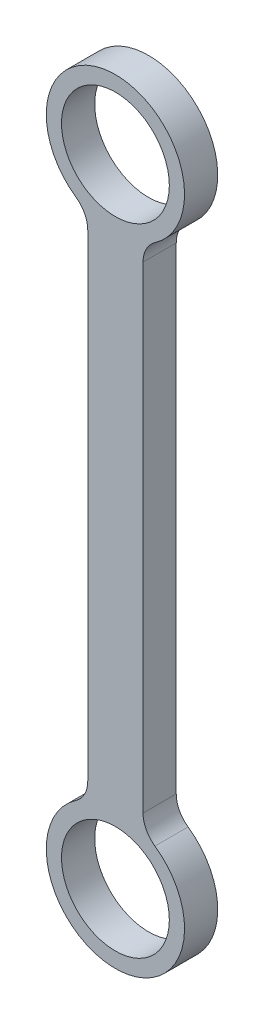
ISO-10303-21;
HEADER;
FILE_DESCRIPTION(('STEP AP214'),'2;1');
FILE_NAME('part.step','',(''),(''),'','','');
FILE_SCHEMA(('AUTOMOTIVE_DESIGN { 1 0 10303 214 1 1 1 1 }'));
ENDSEC;
DATA;
#1=APPLICATION_CONTEXT('core data for automotive mechanical design processes');
#2=APPLICATION_PROTOCOL_DEFINITION('international standard','automotive_design',2000,#1);
#3=PRODUCT_CONTEXT('',#1,'mechanical');
#4=PRODUCT('Part','Part','',(#3));
#5=PRODUCT_RELATED_PRODUCT_CATEGORY('part','',(#4));
#6=PRODUCT_DEFINITION_FORMATION('','',#4);
#7=PRODUCT_DEFINITION_CONTEXT('part definition',#1,'design');
#8=PRODUCT_DEFINITION('design','',#6,#7);
#9=PRODUCT_DEFINITION_SHAPE('','',#8);
#10=(LENGTH_UNIT() NAMED_UNIT(*) SI_UNIT(.MILLI.,.METRE.));
#11=(NAMED_UNIT(*) PLANE_ANGLE_UNIT() SI_UNIT($,.RADIAN.));
#12=(NAMED_UNIT(*) SI_UNIT($,.STERADIAN.) SOLID_ANGLE_UNIT());
#13=UNCERTAINTY_MEASURE_WITH_UNIT(LENGTH_MEASURE(1.E-05),#10,'distance_accuracy_value','');
#14=(GEOMETRIC_REPRESENTATION_CONTEXT(3) GLOBAL_UNCERTAINTY_ASSIGNED_CONTEXT((#13)) GLOBAL_UNIT_ASSIGNED_CONTEXT((#10,
#11,#12)) REPRESENTATION_CONTEXT('',''));
#15=CARTESIAN_POINT('',(0.,0.,0.));
#16=DIRECTION('',(0.,0.,1.));
#17=DIRECTION('',(1.,0.,0.));
#18=AXIS2_PLACEMENT_3D('',#15,#16,#17);
#19=CARTESIAN_POINT('',(0.,0.,6.));
#20=DIRECTION('',(0.,0.,-1.));
#21=DIRECTION('',(-1.,0.,0.));
#22=AXIS2_PLACEMENT_3D('',#19,#20,#21);
#23=CYLINDRICAL_SURFACE('',#22,12.5);
#24=CARTESIAN_POINT('',(0.,0.,0.));
#25=DIRECTION('',(0.,0.,1.));
#26=DIRECTION('',(1.,0.,0.));
#27=AXIS2_PLACEMENT_3D('',#24,#25,#26);
#28=CIRCLE('',#27,12.5);
#29=CARTESIAN_POINT('',(-7.14285714285714,10.2581475831036,0.));
#30=VERTEX_POINT('',#29);
#31=CARTESIAN_POINT('',(7.14285714285714,10.2581475831036,0.));
#32=VERTEX_POINT('',#31);
#33=EDGE_CURVE('E126',#30,#32,#28,.T.);
#34=ORIENTED_EDGE('',*,*,#33,.T.);
#35=DIRECTION('',(0.,0.,-1.));
#36=VECTOR('',#35,1.);
#37=CARTESIAN_POINT('',(7.14285714285714,10.2581475831036,6.));
#38=LINE('',#37,#36);
#39=CARTESIAN_POINT('',(7.14285714285714,10.2581475831036,6.));
#40=VERTEX_POINT('',#39);
#41=EDGE_CURVE('E105',#32,#40,#38,.F.);
#42=ORIENTED_EDGE('',*,*,#41,.T.);
#43=CARTESIAN_POINT('',(0.,0.,6.));
#44=DIRECTION('',(0.,0.,1.));
#45=DIRECTION('',(1.,0.,0.));
#46=AXIS2_PLACEMENT_3D('',#43,#44,#45);
#47=CIRCLE('',#46,12.5);
#48=CARTESIAN_POINT('',(-7.14285714285714,10.2581475831036,6.));
#49=VERTEX_POINT('',#48);
#50=EDGE_CURVE('E141',#49,#40,#47,.T.);
#51=ORIENTED_EDGE('',*,*,#50,.F.);
#52=DIRECTION('',(0.,0.,-1.));
#53=VECTOR('',#52,1.);
#54=CARTESIAN_POINT('',(-7.14285714285714,10.2581475831036,6.));
#55=LINE('',#54,#53);
#56=EDGE_CURVE('E119',#49,#30,#55,.T.);
#57=ORIENTED_EDGE('',*,*,#56,.T.);
#58=EDGE_LOOP('',(#34,#42,#51,#57));
#59=FACE_BOUND('',#58,.T.);
#60=ADVANCED_FACE('F35',(#59),#23,.T.);
#61=CARTESIAN_POINT('',(5.,0.,6.));
#62=DIRECTION('',(-1.,0.,0.));
#63=DIRECTION('',(0.,0.,1.));
#64=AXIS2_PLACEMENT_3D('',#61,#62,#63);
#65=PLANE('',#64);
#66=DIRECTION('',(0.,1.,0.));
#67=VECTOR('',#66,1.);
#68=CARTESIAN_POINT('',(5.,0.,6.));
#69=LINE('',#68,#67);
#70=CARTESIAN_POINT('',(5.,14.3614066163451,6.));
#71=VERTEX_POINT('',#70);
#72=CARTESIAN_POINT('',(5.,100.638593383655,6.));
#73=VERTEX_POINT('',#72);
#74=EDGE_CURVE('E118',#71,#73,#69,.T.);
#75=ORIENTED_EDGE('',*,*,#74,.F.);
#76=DIRECTION('',(0.,0.,1.));
#77=VECTOR('',#76,1.);
#78=CARTESIAN_POINT('',(5.,14.3614066163451,0.));
#79=LINE('',#78,#77);
#80=CARTESIAN_POINT('',(5.,14.3614066163451,0.));
#81=VERTEX_POINT('',#80);
#82=EDGE_CURVE('E104',#71,#81,#79,.F.);
#83=ORIENTED_EDGE('',*,*,#82,.T.);
#84=DIRECTION('',(0.,1.,0.));
#85=VECTOR('',#84,1.);
#86=CARTESIAN_POINT('',(5.,0.,0.));
#87=LINE('',#86,#85);
#88=CARTESIAN_POINT('',(5.,100.638593383655,0.));
#89=VERTEX_POINT('',#88);
#90=EDGE_CURVE('E116',#81,#89,#87,.T.);
#91=ORIENTED_EDGE('',*,*,#90,.T.);
#92=DIRECTION('',(0.,0.,1.));
#93=VECTOR('',#92,1.);
#94=CARTESIAN_POINT('',(5.,100.638593383655,6.));
#95=LINE('',#94,#93);
#96=EDGE_CURVE('E120',#89,#73,#95,.T.);
#97=ORIENTED_EDGE('',*,*,#96,.T.);
#98=EDGE_LOOP('',(#75,#83,#91,#97));
#99=FACE_BOUND('',#98,.T.);
#100=ADVANCED_FACE('F115',(#99),#65,.F.);
#101=CARTESIAN_POINT('',(0.,115.,6.));
#102=DIRECTION('',(0.,0.,-1.));
#103=DIRECTION('',(-1.,0.,0.));
#104=AXIS2_PLACEMENT_3D('',#101,#102,#103);
#105=CYLINDRICAL_SURFACE('',#104,12.5);
#106=CARTESIAN_POINT('',(0.,115.,0.));
#107=DIRECTION('',(0.,0.,1.));
#108=DIRECTION('',(1.,0.,0.));
#109=AXIS2_PLACEMENT_3D('',#106,#107,#108);
#110=CIRCLE('',#109,12.5);
#111=CARTESIAN_POINT('',(7.14285714285715,104.741852416896,0.));
#112=VERTEX_POINT('',#111);
#113=CARTESIAN_POINT('',(-7.14285714285715,104.741852416896,0.));
#114=VERTEX_POINT('',#113);
#115=EDGE_CURVE('E125',#112,#114,#110,.T.);
#116=ORIENTED_EDGE('',*,*,#115,.T.);
#117=DIRECTION('',(0.,0.,-1.));
#118=VECTOR('',#117,1.);
#119=CARTESIAN_POINT('',(-7.14285714285714,104.741852416896,6.));
#120=LINE('',#119,#118);
#121=CARTESIAN_POINT('',(-7.14285714285715,104.741852416896,6.));
#122=VERTEX_POINT('',#121);
#123=EDGE_CURVE('E50',#114,#122,#120,.F.);
#124=ORIENTED_EDGE('',*,*,#123,.T.);
#125=CARTESIAN_POINT('',(0.,115.,6.));
#126=DIRECTION('',(0.,0.,1.));
#127=DIRECTION('',(1.,0.,0.));
#128=AXIS2_PLACEMENT_3D('',#125,#126,#127);
#129=CIRCLE('',#128,12.5);
#130=CARTESIAN_POINT('',(7.14285714285715,104.741852416896,6.));
#131=VERTEX_POINT('',#130);
#132=EDGE_CURVE('E171',#131,#122,#129,.T.);
#133=ORIENTED_EDGE('',*,*,#132,.F.);
#134=DIRECTION('',(0.,0.,-1.));
#135=VECTOR('',#134,1.);
#136=CARTESIAN_POINT('',(7.14285714285715,104.741852416896,6.));
#137=LINE('',#136,#135);
#138=EDGE_CURVE('E152',#131,#112,#137,.T.);
#139=ORIENTED_EDGE('',*,*,#138,.T.);
#140=EDGE_LOOP('',(#116,#124,#133,#139));
#141=FACE_BOUND('',#140,.T.);
#142=ADVANCED_FACE('F181',(#141),#105,.T.);
#143=CARTESIAN_POINT('',(0.,115.,6.));
#144=DIRECTION('',(0.,0.,-1.));
#145=DIRECTION('',(-1.,0.,0.));
#146=AXIS2_PLACEMENT_3D('',#143,#144,#145);
#147=CYLINDRICAL_SURFACE('',#146,9.75);
#148=CARTESIAN_POINT('',(0.,115.,6.));
#149=DIRECTION('',(0.,0.,1.));
#150=DIRECTION('',(1.,0.,0.));
#151=AXIS2_PLACEMENT_3D('',#148,#149,#150);
#152=CIRCLE('',#151,9.75);
#153=CARTESIAN_POINT('',(9.75,115.,6.));
#154=VERTEX_POINT('',#153);
#155=EDGE_CURVE('E178',#154,#154,#152,.T.);
#156=ORIENTED_EDGE('',*,*,#155,.T.);
#157=EDGE_LOOP('',(#156));
#158=FACE_BOUND('',#157,.T.);
#159=CARTESIAN_POINT('',(0.,115.,0.));
#160=DIRECTION('',(0.,0.,1.));
#161=DIRECTION('',(1.,0.,0.));
#162=AXIS2_PLACEMENT_3D('',#159,#160,#161);
#163=CIRCLE('',#162,9.75);
#164=CARTESIAN_POINT('',(9.75,115.,0.));
#165=VERTEX_POINT('',#164);
#166=EDGE_CURVE('E135',#165,#165,#163,.T.);
#167=ORIENTED_EDGE('',*,*,#166,.F.);
#168=EDGE_LOOP('',(#167));
#169=FACE_BOUND('',#168,.T.);
#170=ADVANCED_FACE('F262',(#158,#169),#147,.F.);
#171=CARTESIAN_POINT('',(-5.,0.,6.));
#172=DIRECTION('',(-1.,0.,0.));
#173=DIRECTION('',(0.,0.,1.));
#174=AXIS2_PLACEMENT_3D('',#171,#172,#173);
#175=PLANE('',#174);
#176=DIRECTION('',(0.,1.,0.));
#177=VECTOR('',#176,1.);
#178=CARTESIAN_POINT('',(-5.,0.,0.));
#179=LINE('',#178,#177);
#180=CARTESIAN_POINT('',(-5.,14.3614066163451,0.));
#181=VERTEX_POINT('',#180);
#182=CARTESIAN_POINT('',(-5.,100.638593383655,0.));
#183=VERTEX_POINT('',#182);
#184=EDGE_CURVE('E128',#181,#183,#179,.T.);
#185=ORIENTED_EDGE('',*,*,#184,.F.);
#186=DIRECTION('',(0.,0.,-1.));
#187=VECTOR('',#186,1.);
#188=CARTESIAN_POINT('',(-5.,14.3614066163451,6.));
#189=LINE('',#188,#187);
#190=CARTESIAN_POINT('',(-5.,14.3614066163451,6.));
#191=VERTEX_POINT('',#190);
#192=EDGE_CURVE('E150',#181,#191,#189,.F.);
#193=ORIENTED_EDGE('',*,*,#192,.T.);
#194=DIRECTION('',(0.,1.,0.));
#195=VECTOR('',#194,1.);
#196=CARTESIAN_POINT('',(-5.,0.,6.));
#197=LINE('',#196,#195);
#198=CARTESIAN_POINT('',(-5.,100.638593383655,6.));
#199=VERTEX_POINT('',#198);
#200=EDGE_CURVE('E169',#191,#199,#197,.T.);
#201=ORIENTED_EDGE('',*,*,#200,.T.);
#202=DIRECTION('',(0.,0.,-1.));
#203=VECTOR('',#202,1.);
#204=CARTESIAN_POINT('',(-5.,100.638593383655,6.));
#205=LINE('',#204,#203);
#206=EDGE_CURVE('E147',#199,#183,#205,.T.);
#207=ORIENTED_EDGE('',*,*,#206,.T.);
#208=EDGE_LOOP('',(#185,#193,#201,#207));
#209=FACE_BOUND('',#208,.T.);
#210=ADVANCED_FACE('F176',(#209),#175,.T.);
#211=CARTESIAN_POINT('',(0.,0.,6.));
#212=DIRECTION('',(0.,0.,-1.));
#213=DIRECTION('',(-1.,0.,0.));
#214=AXIS2_PLACEMENT_3D('',#211,#212,#213);
#215=CYLINDRICAL_SURFACE('',#214,9.75);
#216=CARTESIAN_POINT('',(0.,0.,6.));
#217=DIRECTION('',(0.,0.,1.));
#218=DIRECTION('',(1.,0.,0.));
#219=AXIS2_PLACEMENT_3D('',#216,#217,#218);
#220=CIRCLE('',#219,9.75);
#221=CARTESIAN_POINT('',(9.75,0.,6.));
#222=VERTEX_POINT('',#221);
#223=EDGE_CURVE('E142',#222,#222,#220,.T.);
#224=ORIENTED_EDGE('',*,*,#223,.T.);
#225=EDGE_LOOP('',(#224));
#226=FACE_BOUND('',#225,.T.);
#227=CARTESIAN_POINT('',(0.,0.,0.));
#228=DIRECTION('',(0.,0.,1.));
#229=DIRECTION('',(1.,0.,0.));
#230=AXIS2_PLACEMENT_3D('',#227,#228,#229);
#231=CIRCLE('',#230,9.75);
#232=CARTESIAN_POINT('',(9.75,0.,0.));
#233=VERTEX_POINT('',#232);
#234=EDGE_CURVE('E138',#233,#233,#231,.T.);
#235=ORIENTED_EDGE('',*,*,#234,.F.);
#236=EDGE_LOOP('',(#235));
#237=FACE_BOUND('',#236,.T.);
#238=ADVANCED_FACE('F193',(#226,#237),#215,.F.);
#239=CARTESIAN_POINT('',(0.,0.,6.));
#240=DIRECTION('',(0.,0.,1.));
#241=DIRECTION('',(1.,0.,0.));
#242=AXIS2_PLACEMENT_3D('',#239,#240,#241);
#243=PLANE('',#242);
#244=ORIENTED_EDGE('',*,*,#200,.F.);
#245=CARTESIAN_POINT('',(-10.,14.3614066163451,6.));
#246=DIRECTION('',(0.,0.,1.));
#247=DIRECTION('',(1.,0.,0.));
#248=AXIS2_PLACEMENT_3D('',#245,#246,#247);
#249=CIRCLE('',#248,5.);
#250=EDGE_CURVE('E159',#191,#49,#249,.F.);
#251=ORIENTED_EDGE('',*,*,#250,.T.);
#252=ORIENTED_EDGE('',*,*,#50,.T.);
#253=CARTESIAN_POINT('',(10.,14.3614066163451,6.));
#254=DIRECTION('',(0.,0.,1.));
#255=DIRECTION('',(1.,0.,0.));
#256=AXIS2_PLACEMENT_3D('',#253,#254,#255);
#257=CIRCLE('',#256,5.);
#258=EDGE_CURVE('E110',#40,#71,#257,.F.);
#259=ORIENTED_EDGE('',*,*,#258,.T.);
#260=ORIENTED_EDGE('',*,*,#74,.T.);
#261=CARTESIAN_POINT('',(10.,100.638593383655,6.));
#262=DIRECTION('',(0.,0.,1.));
#263=DIRECTION('',(1.,0.,0.));
#264=AXIS2_PLACEMENT_3D('',#261,#262,#263);
#265=CIRCLE('',#264,5.);
#266=EDGE_CURVE('E11',#73,#131,#265,.F.);
#267=ORIENTED_EDGE('',*,*,#266,.T.);
#268=ORIENTED_EDGE('',*,*,#132,.T.);
#269=CARTESIAN_POINT('',(-10.,100.638593383655,6.));
#270=DIRECTION('',(0.,0.,1.));
#271=DIRECTION('',(1.,0.,0.));
#272=AXIS2_PLACEMENT_3D('',#269,#270,#271);
#273=CIRCLE('',#272,5.);
#274=EDGE_CURVE('E163',#122,#199,#273,.F.);
#275=ORIENTED_EDGE('',*,*,#274,.T.);
#276=EDGE_LOOP('',(#244,#251,#252,#259,#260,#267,#268,#275));
#277=FACE_BOUND('',#276,.T.);
#278=ORIENTED_EDGE('',*,*,#155,.F.);
#279=EDGE_LOOP('',(#278));
#280=FACE_BOUND('',#279,.T.);
#281=ORIENTED_EDGE('',*,*,#223,.F.);
#282=EDGE_LOOP('',(#281));
#283=FACE_BOUND('',#282,.T.);
#284=ADVANCED_FACE('F167',(#277,#280,#283),#243,.T.);
#285=CARTESIAN_POINT('',(0.,0.,0.));
#286=DIRECTION('',(0.,0.,1.));
#287=DIRECTION('',(1.,0.,0.));
#288=AXIS2_PLACEMENT_3D('',#285,#286,#287);
#289=PLANE('',#288);
#290=ORIENTED_EDGE('',*,*,#33,.F.);
#291=CARTESIAN_POINT('',(-10.,14.3614066163451,0.));
#292=DIRECTION('',(0.,0.,1.));
#293=DIRECTION('',(1.,0.,0.));
#294=AXIS2_PLACEMENT_3D('',#291,#292,#293);
#295=CIRCLE('',#294,5.);
#296=EDGE_CURVE('E157',#30,#181,#295,.T.);
#297=ORIENTED_EDGE('',*,*,#296,.T.);
#298=ORIENTED_EDGE('',*,*,#184,.T.);
#299=CARTESIAN_POINT('',(-10.,100.638593383655,0.));
#300=DIRECTION('',(0.,0.,1.));
#301=DIRECTION('',(1.,0.,0.));
#302=AXIS2_PLACEMENT_3D('',#299,#300,#301);
#303=CIRCLE('',#302,5.);
#304=EDGE_CURVE('E161',#183,#114,#303,.T.);
#305=ORIENTED_EDGE('',*,*,#304,.T.);
#306=ORIENTED_EDGE('',*,*,#115,.F.);
#307=CARTESIAN_POINT('',(10.,100.638593383655,0.));
#308=DIRECTION('',(0.,0.,1.));
#309=DIRECTION('',(1.,0.,0.));
#310=AXIS2_PLACEMENT_3D('',#307,#308,#309);
#311=CIRCLE('',#310,5.);
#312=EDGE_CURVE('E43',#112,#89,#311,.T.);
#313=ORIENTED_EDGE('',*,*,#312,.T.);
#314=ORIENTED_EDGE('',*,*,#90,.F.);
#315=CARTESIAN_POINT('',(10.,14.3614066163451,0.));
#316=DIRECTION('',(0.,0.,1.));
#317=DIRECTION('',(1.,0.,0.));
#318=AXIS2_PLACEMENT_3D('',#315,#316,#317);
#319=CIRCLE('',#318,5.);
#320=EDGE_CURVE('E100',#81,#32,#319,.T.);
#321=ORIENTED_EDGE('',*,*,#320,.T.);
#322=EDGE_LOOP('',(#290,#297,#298,#305,#306,#313,#314,#321));
#323=FACE_BOUND('',#322,.T.);
#324=ORIENTED_EDGE('',*,*,#166,.T.);
#325=EDGE_LOOP('',(#324));
#326=FACE_BOUND('',#325,.T.);
#327=ORIENTED_EDGE('',*,*,#234,.T.);
#328=EDGE_LOOP('',(#327));
#329=FACE_BOUND('',#328,.T.);
#330=ADVANCED_FACE('F122',(#323,#326,#329),#289,.F.);
#331=CARTESIAN_POINT('',(10.,14.3614066163451,6.));
#332=DIRECTION('',(0.,0.,-1.));
#333=DIRECTION('',(-1.,0.,0.));
#334=AXIS2_PLACEMENT_3D('',#331,#332,#333);
#335=CYLINDRICAL_SURFACE('',#334,5.);
#336=ORIENTED_EDGE('',*,*,#258,.F.);
#337=ORIENTED_EDGE('',*,*,#41,.F.);
#338=ORIENTED_EDGE('',*,*,#320,.F.);
#339=ORIENTED_EDGE('',*,*,#82,.F.);
#340=EDGE_LOOP('',(#336,#337,#338,#339));
#341=FACE_BOUND('',#340,.T.);
#342=ADVANCED_FACE('F103',(#341),#335,.F.);
#343=CARTESIAN_POINT('',(-10.,14.3614066163451,6.));
#344=DIRECTION('',(0.,0.,-1.));
#345=DIRECTION('',(-1.,0.,0.));
#346=AXIS2_PLACEMENT_3D('',#343,#344,#345);
#347=CYLINDRICAL_SURFACE('',#346,5.);
#348=ORIENTED_EDGE('',*,*,#250,.F.);
#349=ORIENTED_EDGE('',*,*,#192,.F.);
#350=ORIENTED_EDGE('',*,*,#296,.F.);
#351=ORIENTED_EDGE('',*,*,#56,.F.);
#352=EDGE_LOOP('',(#348,#349,#350,#351));
#353=FACE_BOUND('',#352,.T.);
#354=ADVANCED_FACE('F215',(#353),#347,.F.);
#355=CARTESIAN_POINT('',(-10.,100.638593383655,6.));
#356=DIRECTION('',(0.,0.,-1.));
#357=DIRECTION('',(-1.,0.,0.));
#358=AXIS2_PLACEMENT_3D('',#355,#356,#357);
#359=CYLINDRICAL_SURFACE('',#358,5.);
#360=ORIENTED_EDGE('',*,*,#274,.F.);
#361=ORIENTED_EDGE('',*,*,#123,.F.);
#362=ORIENTED_EDGE('',*,*,#304,.F.);
#363=ORIENTED_EDGE('',*,*,#206,.F.);
#364=EDGE_LOOP('',(#360,#361,#362,#363));
#365=FACE_BOUND('',#364,.T.);
#366=ADVANCED_FACE('F180',(#365),#359,.F.);
#367=CARTESIAN_POINT('',(10.,100.638593383655,6.));
#368=DIRECTION('',(0.,0.,-1.));
#369=DIRECTION('',(-1.,0.,0.));
#370=AXIS2_PLACEMENT_3D('',#367,#368,#369);
#371=CYLINDRICAL_SURFACE('',#370,5.);
#372=ORIENTED_EDGE('',*,*,#266,.F.);
#373=ORIENTED_EDGE('',*,*,#96,.F.);
#374=ORIENTED_EDGE('',*,*,#312,.F.);
#375=ORIENTED_EDGE('',*,*,#138,.F.);
#376=EDGE_LOOP('',(#372,#373,#374,#375));
#377=FACE_BOUND('',#376,.T.);
#378=ADVANCED_FACE('F37',(#377),#371,.F.);
#379=CLOSED_SHELL('',(#60,#100,#142,#170,#210,#238,#284,#330,#342,#354,#366,#378));
#380=MANIFOLD_SOLID_BREP('B2',#379);
#381=ADVANCED_BREP_SHAPE_REPRESENTATION('',(#18,#380),#14);
#382=SHAPE_DEFINITION_REPRESENTATION(#9,#381);
ENDSEC;
END-ISO-10303-21;
